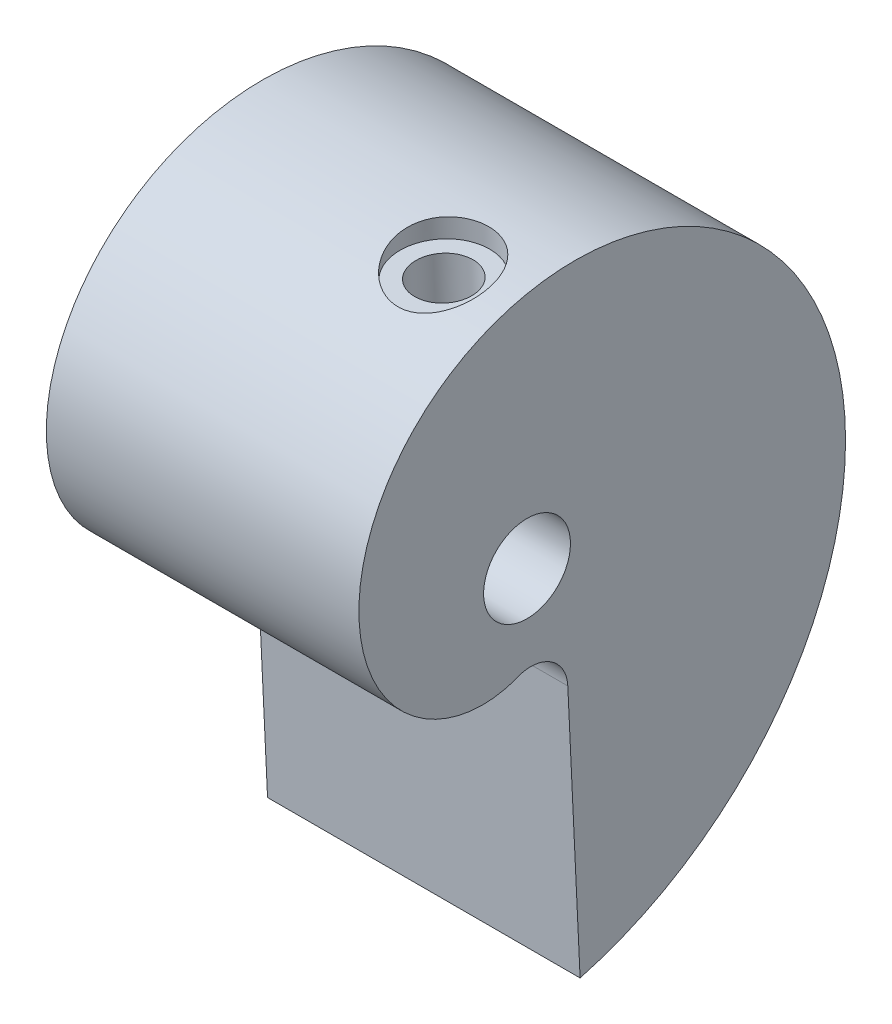
ISO-10303-21;
HEADER;
FILE_DESCRIPTION(('STEP AP214'),'2;1');
FILE_NAME('part.step','',(''),(''),'','','');
FILE_SCHEMA(('AUTOMOTIVE_DESIGN { 1 0 10303 214 1 1 1 1 }'));
ENDSEC;
DATA;
#1=APPLICATION_CONTEXT('core data for automotive mechanical design processes');
#2=APPLICATION_PROTOCOL_DEFINITION('international standard','automotive_design',2000,#1);
#3=PRODUCT_CONTEXT('',#1,'mechanical');
#4=PRODUCT('Part','Part','',(#3));
#5=PRODUCT_RELATED_PRODUCT_CATEGORY('part','',(#4));
#6=PRODUCT_DEFINITION_FORMATION('','',#4);
#7=PRODUCT_DEFINITION_CONTEXT('part definition',#1,'design');
#8=PRODUCT_DEFINITION('design','',#6,#7);
#9=PRODUCT_DEFINITION_SHAPE('','',#8);
#10=(LENGTH_UNIT() NAMED_UNIT(*) SI_UNIT(.MILLI.,.METRE.));
#11=(NAMED_UNIT(*) PLANE_ANGLE_UNIT() SI_UNIT($,.RADIAN.));
#12=(NAMED_UNIT(*) SI_UNIT($,.STERADIAN.) SOLID_ANGLE_UNIT());
#13=UNCERTAINTY_MEASURE_WITH_UNIT(LENGTH_MEASURE(1.E-05),#10,'distance_accuracy_value','');
#14=(GEOMETRIC_REPRESENTATION_CONTEXT(3) GLOBAL_UNCERTAINTY_ASSIGNED_CONTEXT((#13)) GLOBAL_UNIT_ASSIGNED_CONTEXT((#10,
#11,#12)) REPRESENTATION_CONTEXT('',''));
#15=CARTESIAN_POINT('',(0.,0.,0.));
#16=DIRECTION('',(0.,0.,1.));
#17=DIRECTION('',(1.,0.,0.));
#18=AXIS2_PLACEMENT_3D('',#15,#16,#17);
#19=CARTESIAN_POINT('',(21.59,16.3980040897592,0.208936694079272));
#20=DIRECTION('',(1.,0.,0.));
#21=DIRECTION('',(0.,0.,-1.));
#22=AXIS2_PLACEMENT_3D('',#19,#20,#21);
#23=PLANE('',#22);
#24=CARTESIAN_POINT('',(21.59,-26.3254834999287,-3.66701312597946));
#25=CARTESIAN_POINT('',(21.59,-25.8850164099485,-5.29183143138332));
#26=CARTESIAN_POINT('',(21.59,-25.2937709802203,-6.85500985861185));
#27=CARTESIAN_POINT('',(21.59,-23.8451939849136,-9.80629411018198));
#28=CARTESIAN_POINT('',(21.59,-22.987926569709,-11.1943493778112));
#29=CARTESIAN_POINT('',(21.59,-21.0514010056648,-13.7523524342122));
#30=CARTESIAN_POINT('',(21.59,-19.9722145165317,-14.9222640436458));
#31=CARTESIAN_POINT('',(21.59,-17.6424148443339,-17.0111362692066));
#32=CARTESIAN_POINT('',(21.59,-16.3918777440894,-17.9300760548233));
#33=CARTESIAN_POINT('',(21.59,-13.774181132005,-19.4952108297215));
#34=CARTESIAN_POINT('',(21.59,-12.4070989510175,-20.1414006679111));
#35=CARTESIAN_POINT('',(21.59,-9.61304301680638,-21.1506818581234));
#36=CARTESIAN_POINT('',(21.59,-8.18614470800054,-21.5137834309208));
#37=CARTESIAN_POINT('',(21.59,-5.3288100875924,-21.9578966574968));
#38=CARTESIAN_POINT('',(21.59,-3.8984443651538,-22.038932986476));
#39=CARTESIAN_POINT('',(21.59,-1.08794928189315,-21.9307589450492));
#40=CARTESIAN_POINT('',(21.59,0.292117032528461,-21.7415862291151));
#41=CARTESIAN_POINT('',(21.59,2.9528328961559,-21.1147307327981));
#42=CARTESIAN_POINT('',(21.59,4.23342924609723,-20.6770966268395));
#43=CARTESIAN_POINT('',(21.59,6.65237105198453,-19.5836453555955));
#44=CARTESIAN_POINT('',(21.59,7.79067499289227,-18.9278855327688));
#45=CARTESIAN_POINT('',(21.59,9.88997156551444,-17.4355003933537));
#46=CARTESIAN_POINT('',(21.59,10.8509356728284,-16.5989384482919));
#47=CARTESIAN_POINT('',(21.59,12.5693210600784,-14.7874359048066));
#48=CARTESIAN_POINT('',(21.59,13.3267275415238,-13.8125618959728));
#49=CARTESIAN_POINT('',(21.59,14.6212472227952,-11.7701307863269));
#50=CARTESIAN_POINT('',(21.59,15.1583594978757,-10.7026406297588));
#51=CARTESIAN_POINT('',(21.59,16.0052572395325,-8.52186727257846));
#52=CARTESIAN_POINT('',(21.59,16.3150552236038,-7.40864857435838));
#53=CARTESIAN_POINT('',(21.59,16.7098316537026,-5.1825201174866));
#54=CARTESIAN_POINT('',(21.59,16.7948350803545,-4.06966980389497));
#55=CARTESIAN_POINT('',(21.59,16.7515036458065,-1.88772278855217));
#56=CARTESIAN_POINT('',(21.59,16.6232047553048,-0.818678144435623));
#57=CARTESIAN_POINT('',(21.59,16.1728034242135,1.23655153259428));
#58=CARTESIAN_POINT('',(21.59,15.8507460504129,2.22269384951728));
#59=CARTESIAN_POINT('',(21.59,15.0391926205607,4.07878041726697));
#60=CARTESIAN_POINT('',(21.59,14.5497485015278,4.94869279896394));
#61=CARTESIAN_POINT('',(21.59,13.4351525169527,6.5458728071125));
#62=CARTESIAN_POINT('',(21.59,12.8100570020662,7.27312041446994));
#63=CARTESIAN_POINT('',(21.59,11.4596211058448,8.56619770795014));
#64=CARTESIAN_POINT('',(21.59,10.7343389103516,9.13201969506656));
#65=CARTESIAN_POINT('',(21.59,8.46432492032774,10.5713349527582));
#66=CARTESIAN_POINT('',(21.59,6.82631034463374,11.1827796887629));
#67=CARTESIAN_POINT('',(21.59,3.59680348317033,11.7204279571445));
#68=CARTESIAN_POINT('',(21.59,2.00685947245537,11.6474809761802));
#69=CARTESIAN_POINT('',(21.59,-0.874358563474903,10.9424993264994));
#70=CARTESIAN_POINT('',(21.59,-2.16461256267651,10.3118298030999));
#71=CARTESIAN_POINT('',(21.59,-4.28109326467023,8.69840573541426));
#72=CARTESIAN_POINT('',(21.59,-5.10697539238301,7.71726162806799));
#73=CARTESIAN_POINT('',(21.59,-6.23707693613607,5.64499605846387));
#74=CARTESIAN_POINT('',(21.59,-6.54165034000696,4.55542957813348));
#75=CARTESIAN_POINT('',(21.59,-6.67904709626705,2.49487199667445));
#76=CARTESIAN_POINT('',(21.59,-6.51282232630776,1.52510200770758));
#77=CARTESIAN_POINT('',(21.59,-6.17940617515592,0.700777065763977));
#78=B_SPLINE_CURVE_WITH_KNOTS('',3,(#24,#25,#26,#27,#28,#29,#30,#31,#32,#33,#34,#35,#36,#37,#38,
#39,#40,#41,#42,#43,#44,#45,#46,#47,#48,#49,#50,#51,#52,#53,#54,#55,#56,#57,#58,#59,#60,#61,#62,
#63,#64,#65,#66,#67,#68,#69,#70,#71,#72,#73,#74,#75,#76,#77),.UNSPECIFIED.,.F.,.F.,(4,2,2,2,2,2,
2,2,2,2,2,2,2,2,2,2,2,2,2,2,2,2,2,2,2,2,4),(0.,0.03125,0.0625,0.09375,0.125,0.15625,0.1875,
0.21875,0.25,0.28125,0.3125,0.34375,0.375,0.40625,0.4375,0.46875,0.5,0.53125,0.5625,0.59375,
0.625,0.6875,0.75,0.8125,0.875,0.9375,1.),.UNSPECIFIED.);
#79=CARTESIAN_POINT('',(21.59,-26.3254834999287,-3.66701312597946));
#80=VERTEX_POINT('',#79);
#81=CARTESIAN_POINT('',(21.59,-6.17940617515592,0.700777065763977));
#82=VERTEX_POINT('',#81);
#83=EDGE_CURVE('E64',#80,#82,#78,.T.);
#84=ORIENTED_EDGE('',*,*,#83,.T.);
#85=CARTESIAN_POINT('',(21.59,-8.55278837318837,-0.259188983321582));
#86=DIRECTION('',(-1.,0.,0.));
#87=DIRECTION('',(0.,0.,-1.));
#88=AXIS2_PLACEMENT_3D('',#85,#86,#87);
#89=CIRCLE('',#88,2.56017145389412);
#90=CARTESIAN_POINT('',(21.59,-8.4312368938815,-2.81647330682036));
#91=VERTEX_POINT('',#90);
#92=EDGE_CURVE('E60',#82,#91,#89,.T.);
#93=ORIENTED_EDGE('',*,*,#92,.T.);
#94=DIRECTION('',(0.,-0.998872290216758,-0.0474778668131734));
#95=VECTOR('',#94,1.);
#96=CARTESIAN_POINT('',(21.59,-26.3254834999287,-3.66701312597946));
#97=LINE('',#96,#95);
#98=EDGE_CURVE('E40',#91,#80,#97,.T.);
#99=ORIENTED_EDGE('',*,*,#98,.T.);
#100=EDGE_LOOP('',(#84,#93,#99));
#101=FACE_BOUND('',#100,.T.);
#102=CARTESIAN_POINT('',(21.59,0.,0.));
#103=DIRECTION('',(1.,0.,0.));
#104=DIRECTION('',(0.,0.,-1.));
#105=AXIS2_PLACEMENT_3D('',#102,#103,#104);
#106=CIRCLE('',#105,3.);
#107=CARTESIAN_POINT('',(21.59,0.,-3.));
#108=VERTEX_POINT('',#107);
#109=EDGE_CURVE('E73',#108,#108,#106,.T.);
#110=ORIENTED_EDGE('',*,*,#109,.F.);
#111=EDGE_LOOP('',(#110));
#112=FACE_BOUND('',#111,.T.);
#113=ADVANCED_FACE('F15',(#101,#112),#23,.T.);
#114=CARTESIAN_POINT('',(0.,16.3980040897592,0.208936694079272));
#115=DIRECTION('',(1.,0.,0.));
#116=DIRECTION('',(0.,0.,-1.));
#117=AXIS2_PLACEMENT_3D('',#114,#115,#116);
#118=PLANE('',#117);
#119=CARTESIAN_POINT('',(0.,-26.3254834999287,-3.66701312597946));
#120=CARTESIAN_POINT('',(0.,-25.8850164099485,-5.29183143138332));
#121=CARTESIAN_POINT('',(0.,-25.2937709802203,-6.85500985861185));
#122=CARTESIAN_POINT('',(0.,-23.8451939849136,-9.80629411018198));
#123=CARTESIAN_POINT('',(0.,-22.987926569709,-11.1943493778112));
#124=CARTESIAN_POINT('',(0.,-21.0514010056648,-13.7523524342122));
#125=CARTESIAN_POINT('',(0.,-19.9722145165317,-14.9222640436458));
#126=CARTESIAN_POINT('',(0.,-17.6424148443339,-17.0111362692066));
#127=CARTESIAN_POINT('',(0.,-16.3918777440894,-17.9300760548233));
#128=CARTESIAN_POINT('',(0.,-13.774181132005,-19.4952108297215));
#129=CARTESIAN_POINT('',(0.,-12.4070989510175,-20.1414006679111));
#130=CARTESIAN_POINT('',(0.,-9.61304301680638,-21.1506818581234));
#131=CARTESIAN_POINT('',(0.,-8.18614470800054,-21.5137834309208));
#132=CARTESIAN_POINT('',(0.,-5.3288100875924,-21.9578966574968));
#133=CARTESIAN_POINT('',(0.,-3.8984443651538,-22.038932986476));
#134=CARTESIAN_POINT('',(0.,-1.08794928189315,-21.9307589450492));
#135=CARTESIAN_POINT('',(0.,0.292117032528461,-21.7415862291151));
#136=CARTESIAN_POINT('',(0.,2.9528328961559,-21.1147307327981));
#137=CARTESIAN_POINT('',(0.,4.23342924609723,-20.6770966268395));
#138=CARTESIAN_POINT('',(0.,6.65237105198453,-19.5836453555955));
#139=CARTESIAN_POINT('',(0.,7.79067499289227,-18.9278855327688));
#140=CARTESIAN_POINT('',(0.,9.88997156551444,-17.4355003933537));
#141=CARTESIAN_POINT('',(0.,10.8509356728284,-16.5989384482919));
#142=CARTESIAN_POINT('',(0.,12.5693210600784,-14.7874359048066));
#143=CARTESIAN_POINT('',(0.,13.3267275415238,-13.8125618959728));
#144=CARTESIAN_POINT('',(0.,14.6212472227952,-11.7701307863269));
#145=CARTESIAN_POINT('',(0.,15.1583594978757,-10.7026406297588));
#146=CARTESIAN_POINT('',(0.,16.0052572395325,-8.52186727257846));
#147=CARTESIAN_POINT('',(0.,16.3150552236038,-7.40864857435838));
#148=CARTESIAN_POINT('',(0.,16.7098316537026,-5.1825201174866));
#149=CARTESIAN_POINT('',(0.,16.7948350803545,-4.06966980389497));
#150=CARTESIAN_POINT('',(0.,16.7515036458065,-1.88772278855217));
#151=CARTESIAN_POINT('',(0.,16.6232047553048,-0.818678144435623));
#152=CARTESIAN_POINT('',(0.,16.1728034242135,1.23655153259428));
#153=CARTESIAN_POINT('',(0.,15.8507460504129,2.22269384951728));
#154=CARTESIAN_POINT('',(0.,15.0391926205607,4.07878041726697));
#155=CARTESIAN_POINT('',(0.,14.5497485015278,4.94869279896394));
#156=CARTESIAN_POINT('',(0.,13.4351525169527,6.5458728071125));
#157=CARTESIAN_POINT('',(0.,12.8100570020662,7.27312041446994));
#158=CARTESIAN_POINT('',(0.,11.4596211058448,8.56619770795014));
#159=CARTESIAN_POINT('',(0.,10.7343389103516,9.13201969506656));
#160=CARTESIAN_POINT('',(0.,8.46432492032774,10.5713349527582));
#161=CARTESIAN_POINT('',(0.,6.82631034463374,11.1827796887629));
#162=CARTESIAN_POINT('',(0.,3.59680348317033,11.7204279571445));
#163=CARTESIAN_POINT('',(0.,2.00685947245537,11.6474809761802));
#164=CARTESIAN_POINT('',(0.,-0.874358563474903,10.9424993264994));
#165=CARTESIAN_POINT('',(0.,-2.16461256267651,10.3118298030999));
#166=CARTESIAN_POINT('',(0.,-4.28109326467023,8.69840573541426));
#167=CARTESIAN_POINT('',(0.,-5.10697539238301,7.71726162806799));
#168=CARTESIAN_POINT('',(0.,-6.23707693613607,5.64499605846387));
#169=CARTESIAN_POINT('',(0.,-6.54165034000696,4.55542957813348));
#170=CARTESIAN_POINT('',(0.,-6.67904709626705,2.49487199667445));
#171=CARTESIAN_POINT('',(0.,-6.51282232630776,1.52510200770758));
#172=CARTESIAN_POINT('',(0.,-6.17940617515592,0.700777065763977));
#173=B_SPLINE_CURVE_WITH_KNOTS('',3,(#119,#120,#121,#122,#123,#124,#125,#126,#127,#128,#129,
#130,#131,#132,#133,#134,#135,#136,#137,#138,#139,#140,#141,#142,#143,#144,#145,#146,#147,#148,
#149,#150,#151,#152,#153,#154,#155,#156,#157,#158,#159,#160,#161,#162,#163,#164,#165,#166,#167,
#168,#169,#170,#171,#172),.UNSPECIFIED.,.F.,.F.,(4,2,2,2,2,2,2,2,2,2,2,2,2,2,2,2,2,2,2,2,2,2,2,
2,2,2,4),(0.,0.03125,0.0625,0.09375,0.125,0.15625,0.1875,0.21875,0.25,0.28125,0.3125,0.34375,
0.375,0.40625,0.4375,0.46875,0.5,0.53125,0.5625,0.59375,0.625,0.6875,0.75,0.8125,0.875,0.9375,
1.),.UNSPECIFIED.);
#174=CARTESIAN_POINT('',(0.,-26.3254834999287,-3.66701312597946));
#175=VERTEX_POINT('',#174);
#176=CARTESIAN_POINT('',(0.,-6.17940617515592,0.700777065763977));
#177=VERTEX_POINT('',#176);
#178=EDGE_CURVE('E70',#175,#177,#173,.T.);
#179=ORIENTED_EDGE('',*,*,#178,.F.);
#180=DIRECTION('',(0.,-0.998872290216758,-0.0474778668131734));
#181=VECTOR('',#180,1.);
#182=CARTESIAN_POINT('',(0.,-26.3254834999287,-3.66701312597946));
#183=LINE('',#182,#181);
#184=CARTESIAN_POINT('',(0.,-8.4312368938815,-2.81647330682036));
#185=VERTEX_POINT('',#184);
#186=EDGE_CURVE('E57',#185,#175,#183,.T.);
#187=ORIENTED_EDGE('',*,*,#186,.F.);
#188=CARTESIAN_POINT('',(0.,-8.55278837318837,-0.259188983321582));
#189=DIRECTION('',(-1.,0.,0.));
#190=DIRECTION('',(0.,0.,-1.));
#191=AXIS2_PLACEMENT_3D('',#188,#189,#190);
#192=CIRCLE('',#191,2.56017145389412);
#193=EDGE_CURVE('E52',#177,#185,#192,.T.);
#194=ORIENTED_EDGE('',*,*,#193,.F.);
#195=EDGE_LOOP('',(#179,#187,#194));
#196=FACE_BOUND('',#195,.T.);
#197=CARTESIAN_POINT('',(0.,0.,0.));
#198=DIRECTION('',(1.,0.,0.));
#199=DIRECTION('',(0.,0.,-1.));
#200=AXIS2_PLACEMENT_3D('',#197,#198,#199);
#201=CIRCLE('',#200,3.);
#202=CARTESIAN_POINT('',(0.,0.,-3.));
#203=VERTEX_POINT('',#202);
#204=EDGE_CURVE('E77',#203,#203,#201,.T.);
#205=ORIENTED_EDGE('',*,*,#204,.T.);
#206=EDGE_LOOP('',(#205));
#207=FACE_BOUND('',#206,.T.);
#208=ADVANCED_FACE('F108',(#196,#207),#118,.F.);
#209=DIRECTION('',(-1.,0.,0.));
#210=VECTOR('',#209,1.);
#211=SURFACE_OF_LINEAR_EXTRUSION('',#78,#210);
#212=CARTESIAN_POINT('',(16.565,16.7506396740937,-2.3824020185819));
#213=CARTESIAN_POINT('',(16.7433125657749,16.7506413895993,-2.38239572343409));
#214=CARTESIAN_POINT('',(16.9217084574211,16.749821870359,-2.36735698221768));
#215=CARTESIAN_POINT('',(17.2735404531971,16.7463257784659,-2.30760094349494));
#216=CARTESIAN_POINT('',(17.4469725353157,16.7436477419284,-2.26286025207603));
#217=CARTESIAN_POINT('',(17.7838175619757,16.7358008377302,-2.14500470832748));
#218=CARTESIAN_POINT('',(17.9472329710051,16.7306325855541,-2.07189686812296));
#219=CARTESIAN_POINT('',(18.2593967109722,16.7168613322798,-1.89946022909937));
#220=CARTESIAN_POINT('',(18.4081474456539,16.7082588952633,-1.80013573740177));
#221=CARTESIAN_POINT('',(18.6865194273289,16.6865245866847,-1.57839471352308));
#222=CARTESIAN_POINT('',(18.816172777858,16.6734004432769,-1.45601774158622));
#223=CARTESIAN_POINT('',(19.0529395131531,16.6415294219983,-1.19174783860988));
#224=CARTESIAN_POINT('',(19.1600538561791,16.6227827832536,-1.04985573769259));
#225=CARTESIAN_POINT('',(19.348142330831,16.5789328491663,-0.751848833363513));
#226=CARTESIAN_POINT('',(19.4292768024721,16.553870320362,-0.595829205294697));
#227=CARTESIAN_POINT('',(19.5642185684297,16.4968714939526,-0.273578315973268));
#228=CARTESIAN_POINT('',(19.6180270069779,16.4649354842427,-0.10734748262456));
#229=CARTESIAN_POINT('',(19.6971716405541,16.394258927079,0.230275295922528));
#230=CARTESIAN_POINT('',(19.722518372012,16.3555209038535,0.40166530706758));
#231=CARTESIAN_POINT('',(19.744621054064,16.2718922700363,0.744772007699112));
#232=CARTESIAN_POINT('',(19.7413740122333,16.2270010159743,0.916488729496721));
#233=CARTESIAN_POINT('',(19.7065779354297,16.131231758128,1.25944455369325));
#234=CARTESIAN_POINT('',(19.6744043268891,16.0802432751121,1.43058903606567));
#235=CARTESIAN_POINT('',(19.5822767862168,15.9748963486612,1.76413828861455));
#236=CARTESIAN_POINT('',(19.5223164634281,15.9205371324849,1.92654103868751));
#237=CARTESIAN_POINT('',(19.37349122948,15.8084495214842,2.24504073687003));
#238=CARTESIAN_POINT('',(19.2835681169074,15.7506732515505,2.40062724447312));
#239=CARTESIAN_POINT('',(19.0779746661179,15.6367051121502,2.69441582491913));
#240=CARTESIAN_POINT('',(18.9622977115637,15.5805136540196,2.83261341612552));
#241=CARTESIAN_POINT('',(18.7052597507175,15.4718331439367,3.09055875271198));
#242=CARTESIAN_POINT('',(18.563448220764,15.4194359017119,3.20990127896188));
#243=CARTESIAN_POINT('',(18.3354405886196,15.3473231379403,3.36967949623941));
#244=CARTESIAN_POINT('',(18.2568465828785,15.324356219765,3.41975316580401));
#245=CARTESIAN_POINT('',(18.0950375543645,15.2810258558235,3.51306824531798));
#246=CARTESIAN_POINT('',(18.0118248362869,15.2606611280455,3.55631302212939));
#247=CARTESIAN_POINT('',(17.8449506674736,15.2237661173167,3.63386819559383));
#248=CARTESIAN_POINT('',(17.7614559986682,15.2071103843645,3.66847836816939));
#249=CARTESIAN_POINT('',(17.5913768396874,15.1769484403086,3.73067224852884));
#250=CARTESIAN_POINT('',(17.5047938330402,15.1634407398821,3.75825927950836));
#251=CARTESIAN_POINT('',(17.3291969657524,15.1398794833412,3.80610837444833));
#252=CARTESIAN_POINT('',(17.2401839282175,15.1298247729152,3.82637288639647));
#253=CARTESIAN_POINT('',(17.0604349726318,15.113407621694,3.85934439959767));
#254=CARTESIAN_POINT('',(16.9696991833952,15.1070449059538,3.87205196362262));
#255=CARTESIAN_POINT('',(16.7945533182601,15.0985240892335,3.88904578045354));
#256=CARTESIAN_POINT('',(16.7102142050666,15.0960717840662,3.89392151576271));
#257=CARTESIAN_POINT('',(16.5413523279664,15.0944819837441,3.89708380613252));
#258=CARTESIAN_POINT('',(16.4568295124437,15.0953455878203,3.89536817614142));
#259=CARTESIAN_POINT('',(16.2883132554156,15.1003719089667,3.88536114739973));
#260=CARTESIAN_POINT('',(16.2043195602009,15.1045329006177,3.87707318774104));
#261=CARTESIAN_POINT('',(16.0374380848698,15.1160570440926,3.85402351718646));
#262=CARTESIAN_POINT('',(15.9545507303056,15.1234213934654,3.83925938520938));
#263=CARTESIAN_POINT('',(15.7135282259701,15.1495616401688,3.78655914799319));
#264=CARTESIAN_POINT('',(15.5576580863421,15.1725644974324,3.73987333526957));
#265=CARTESIAN_POINT('',(15.2563374938122,15.2283883617697,3.6243856032296));
#266=CARTESIAN_POINT('',(15.1108890695337,15.2612112739512,3.55557939232459));
#267=CARTESIAN_POINT('',(14.8265360489511,15.3363613688962,3.39404776600376));
#268=CARTESIAN_POINT('',(14.6883111815686,15.3790784167601,3.30030741267247));
#269=CARTESIAN_POINT('',(14.4294546693891,15.4703504029779,3.09340467821783));
#270=CARTESIAN_POINT('',(14.3088294301683,15.5189074551929,2.98023525813181));
#271=CARTESIAN_POINT('',(14.0789724060991,15.6231462990423,2.72781772189997));
#272=CARTESIAN_POINT('',(13.9713199073631,15.6790889471381,2.58723636566584));
#273=CARTESIAN_POINT('',(13.7815053033552,15.7918180971415,2.29008118723744));
#274=CARTESIAN_POINT('',(13.6993495787082,15.8486048065575,2.13350337490384));
#275=CARTESIAN_POINT('',(13.5602533042469,15.9623970325448,1.80219910865937));
#276=CARTESIAN_POINT('',(13.504326409703,16.0193369007987,1.62702235329759));
#277=CARTESIAN_POINT('',(13.4242595372715,16.1287696936005,1.26820289867208));
#278=CARTESIAN_POINT('',(13.4001155032531,16.1812631847952,1.0845612827911));
#279=CARTESIAN_POINT('',(13.385193870193,16.2787719932153,0.718254653214319));
#280=CARTESIAN_POINT('',(13.3936966228172,16.3239259866846,0.535656438380682));
#281=CARTESIAN_POINT('',(13.4429083099938,16.4069046087537,0.173155051099132));
#282=CARTESIAN_POINT('',(13.4836093005975,16.4447310423436,-0.00674877495435066));
#283=CARTESIAN_POINT('',(13.5942352875637,16.5112585207308,-0.350944470852361));
#284=CARTESIAN_POINT('',(13.662934134937,16.5402625664061,-0.515572664111006));
#285=CARTESIAN_POINT('',(13.8276352586509,16.5913323509495,-0.831717074035158));
#286=CARTESIAN_POINT('',(13.9236341626166,16.6133989460922,-0.983234907209561));
#287=CARTESIAN_POINT('',(14.1382408076017,16.6509650936835,-1.26576374035269));
#288=CARTESIAN_POINT('',(14.2564004615726,16.6665779170517,-1.39710052998255));
#289=CARTESIAN_POINT('',(14.5131439312932,16.692803887894,-1.63864995249749));
#290=CARTESIAN_POINT('',(14.6517311068004,16.7034162117183,-1.74885910360259));
#291=CARTESIAN_POINT('',(14.9458446839421,16.7207600224453,-1.9451849781874));
#292=CARTESIAN_POINT('',(15.1014212227303,16.7274796324812,-2.03122756112737));
#293=CARTESIAN_POINT('',(15.4247138575761,16.7380174528368,-2.17622583051713));
#294=CARTESIAN_POINT('',(15.592420784005,16.7418378301567,-2.23520173460522));
#295=CARTESIAN_POINT('',(15.8944508944589,16.7467084225448,-2.31383530128008));
#296=CARTESIAN_POINT('',(16.0272363012908,16.7482011961144,-2.33950607055206));
#297=CARTESIAN_POINT('',(16.2949985372011,16.7501661752923,-2.37379186153075));
#298=CARTESIAN_POINT('',(16.429975378834,16.7506383750518,-2.38240678549187));
#299=CARTESIAN_POINT('',(16.565,16.7506396740937,-2.3824020185819));
#300=B_SPLINE_CURVE_WITH_KNOTS('',3,(#212,#213,#214,#215,#216,#217,#218,#219,#220,#221,#222,
#223,#224,#225,#226,#227,#228,#229,#230,#231,#232,#233,#234,#235,#236,#237,#238,#239,#240,#241,
#242,#243,#244,#245,#246,#247,#248,#249,#250,#251,#252,#253,#254,#255,#256,#257,#258,#259,#260,
#261,#262,#263,#264,#265,#266,#267,#268,#269,#270,#271,#272,#273,#274,#275,#276,#277,#278,#279,
#280,#281,#282,#283,#284,#285,#286,#287,#288,#289,#290,#291,#292,#293,#294,#295,#296,#297,#298,
#299),.UNSPECIFIED.,.T.,.F.,(4,2,2,2,2,2,2,2,2,2,2,2,2,2,2,2,2,2,2,2,2,2,2,2,2,2,2,2,2,2,2,2,2,
2,2,2,2,2,2,2,2,2,2,4),(0.,0.53445164589435,1.06932473792819,1.60406569789055,2.13871886013214,
2.67246273028415,3.2061839033957,3.73654461265796,4.26688311212228,4.79702521723492,
5.32722280398092,5.86915066299671,6.41120322172102,6.97489189795413,7.53872555709591,
8.1133856989789,8.40100316382574,8.6884783783365,8.96383534701767,9.23906177966749,
9.51419611619281,9.7893099606797,10.042539219592,10.295852431789,10.5490331806023,
10.8023086604135,11.2929022099079,11.7835909971805,12.2985553916675,12.8137067479945,
13.3682975128205,13.9230269535227,14.4977165883669,15.0723328741687,15.6343561150362,
16.1962407367653,16.7357872484509,17.2752671389078,17.8048292042514,18.3344784651681,
18.8657353155608,19.3965946916137,19.8012981803549,20.2060039884107),.UNSPECIFIED.);
#301=CARTESIAN_POINT('',(16.565,16.7506396740937,-2.3824020185819));
#302=VERTEX_POINT('',#301);
#303=EDGE_CURVE('E88',#302,#302,#300,.T.);
#304=ORIENTED_EDGE('',*,*,#303,.T.);
#305=EDGE_LOOP('',(#304));
#306=FACE_BOUND('',#305,.T.);
#307=ORIENTED_EDGE('',*,*,#178,.T.);
#308=DIRECTION('',(-1.,0.,0.));
#309=VECTOR('',#308,1.);
#310=CARTESIAN_POINT('',(21.59,-6.17940617515592,0.700777065763977));
#311=LINE('',#310,#309);
#312=EDGE_CURVE('E9',#82,#177,#311,.T.);
#313=ORIENTED_EDGE('',*,*,#312,.F.);
#314=ORIENTED_EDGE('',*,*,#83,.F.);
#315=DIRECTION('',(-1.,0.,0.));
#316=VECTOR('',#315,1.);
#317=CARTESIAN_POINT('',(21.59,-26.3254834999287,-3.66701312597946));
#318=LINE('',#317,#316);
#319=EDGE_CURVE('E71',#80,#175,#318,.T.);
#320=ORIENTED_EDGE('',*,*,#319,.T.);
#321=EDGE_LOOP('',(#307,#313,#314,#320));
#322=FACE_BOUND('',#321,.T.);
#323=ADVANCED_FACE('F17',(#306,#322),#211,.F.);
#324=CARTESIAN_POINT('',(21.59,-8.55278837318837,-0.259188983321582));
#325=DIRECTION('',(-1.,0.,0.));
#326=DIRECTION('',(0.,0.,1.));
#327=AXIS2_PLACEMENT_3D('',#324,#325,#326);
#328=CYLINDRICAL_SURFACE('',#327,2.56017145389412);
#329=ORIENTED_EDGE('',*,*,#193,.T.);
#330=DIRECTION('',(-1.,0.,0.));
#331=VECTOR('',#330,1.);
#332=CARTESIAN_POINT('',(21.59,-8.4312368938815,-2.81647330682036));
#333=LINE('',#332,#331);
#334=EDGE_CURVE('E31',#91,#185,#333,.T.);
#335=ORIENTED_EDGE('',*,*,#334,.F.);
#336=ORIENTED_EDGE('',*,*,#92,.F.);
#337=ORIENTED_EDGE('',*,*,#312,.T.);
#338=EDGE_LOOP('',(#329,#335,#336,#337));
#339=FACE_BOUND('',#338,.T.);
#340=ADVANCED_FACE('F61',(#339),#328,.F.);
#341=CARTESIAN_POINT('',(21.59,-26.3254834999287,-3.66701312597946));
#342=DIRECTION('',(0.,0.0474778668131734,-0.998872290216758));
#343=DIRECTION('',(0.,0.998872290216758,0.0474778668131734));
#344=AXIS2_PLACEMENT_3D('',#341,#342,#343);
#345=PLANE('',#344);
#346=ORIENTED_EDGE('',*,*,#186,.T.);
#347=ORIENTED_EDGE('',*,*,#319,.F.);
#348=ORIENTED_EDGE('',*,*,#98,.F.);
#349=ORIENTED_EDGE('',*,*,#334,.T.);
#350=EDGE_LOOP('',(#346,#347,#348,#349));
#351=FACE_BOUND('',#350,.T.);
#352=ADVANCED_FACE('F104',(#351),#345,.F.);
#353=CARTESIAN_POINT('',(21.59,0.,0.));
#354=DIRECTION('',(-1.,0.,0.));
#355=DIRECTION('',(0.,0.,1.));
#356=AXIS2_PLACEMENT_3D('',#353,#354,#355);
#357=CYLINDRICAL_SURFACE('',#356,3.);
#358=CARTESIAN_POINT('',(16.565,2.12028038204539,2.12235979549027));
#359=CARTESIAN_POINT('',(16.4667328598408,2.12028848918387,2.12235574640076));
#360=CARTESIAN_POINT('',(16.3684396592825,2.12726700712759,2.11544854411303));
#361=CARTESIAN_POINT('',(16.1753956042412,2.15382911691391,2.08838492945828));
#362=CARTESIAN_POINT('',(16.0806515368345,2.17343567338186,2.06820437751953));
#363=CARTESIAN_POINT('',(15.898115540295,2.22182310173142,2.01611940184166));
#364=CARTESIAN_POINT('',(15.8102646347584,2.25051228608713,1.98433167860403));
#365=CARTESIAN_POINT('',(15.6415179949459,2.31379446378662,1.91016493745002));
#366=CARTESIAN_POINT('',(15.5606235348317,2.34838853523675,1.86778398477872));
#367=CARTESIAN_POINT('',(15.3939764145017,2.42634419581015,1.76567376420377));
#368=CARTESIAN_POINT('',(15.3095005764119,2.47022479874888,1.70425677328391));
#369=CARTESIAN_POINT('',(15.1512681262757,2.55831415648357,1.56893677481745));
#370=CARTESIAN_POINT('',(15.0775234546585,2.60252322014981,1.49502005366527));
#371=CARTESIAN_POINT('',(14.9319381685596,2.69434111659312,1.32338517364023));
#372=CARTESIAN_POINT('',(14.8620133455485,2.74147712399974,1.22376200962437));
#373=CARTESIAN_POINT('',(14.74092456293,2.82705144975862,1.01040221396568));
#374=CARTESIAN_POINT('',(14.6897263388148,2.86550560364039,0.896691873719949));
#375=CARTESIAN_POINT('',(14.6194406320562,2.92138993541408,0.688486460837518));
#376=CARTESIAN_POINT('',(14.5955107790667,2.94167661806749,0.596380838870981));
#377=CARTESIAN_POINT('',(14.5610706488714,2.97361755963886,0.408255826934814));
#378=CARTESIAN_POINT('',(14.550550190733,2.98527836483119,0.31223946338016));
#379=CARTESIAN_POINT('',(14.5435070950218,2.99921453700448,0.118857670982177));
#380=CARTESIAN_POINT('',(14.5470072123757,3.00147463482578,0.0214903048783783));
#381=CARTESIAN_POINT('',(14.5678489053777,2.99664936371328,-0.171518644435029));
#382=CARTESIAN_POINT('',(14.5851945804805,2.98956122650674,-0.267159707935346));
#383=CARTESIAN_POINT('',(14.6323848829118,2.96712722760513,-0.452468583282781));
#384=CARTESIAN_POINT('',(14.6620100738361,2.95192505613619,-0.542210701604351));
#385=CARTESIAN_POINT('',(14.7324642390206,2.91474396742281,-0.715642458399995));
#386=CARTESIAN_POINT('',(14.7732953323774,2.89276376831946,-0.799330948314167));
#387=CARTESIAN_POINT('',(14.8700346253892,2.8409088137854,-0.968460757395493));
#388=CARTESIAN_POINT('',(14.9271235396893,2.81042345250388,-1.05303628307403));
#389=CARTESIAN_POINT('',(15.052107400767,2.74554521098296,-1.21218164141392));
#390=CARTESIAN_POINT('',(15.1200150156509,2.71114776358467,-1.28673955296213));
#391=CARTESIAN_POINT('',(15.2776434629101,2.63524990882614,-1.43652944196564));
#392=CARTESIAN_POINT('',(15.3691138068383,2.59351953387313,-1.50981173568687));
#393=CARTESIAN_POINT('',(15.5641707375766,2.51308481925863,-1.64020286542295));
#394=CARTESIAN_POINT('',(15.6677497479923,2.47437861240433,-1.69732173916104));
#395=CARTESIAN_POINT('',(15.8599239808636,2.41399774725226,-1.78175338308866));
#396=CARTESIAN_POINT('',(15.9462288128377,2.39046162805908,-1.81292374997661));
#397=CARTESIAN_POINT('',(16.1239987409443,2.35152611340619,-1.8631546249348));
#398=CARTESIAN_POINT('',(16.2154541774374,2.33611201342263,-1.88223703043339));
#399=CARTESIAN_POINT('',(16.4021128112496,2.31584458356227,-1.90712969037208));
#400=CARTESIAN_POINT('',(16.4973395024567,2.31107375592378,-1.91283627813399));
#401=CARTESIAN_POINT('',(16.6874607323001,2.31329557478278,-1.91014793487933));
#402=CARTESIAN_POINT('',(16.7823552399239,2.32028929172951,-1.90175172065692));
#403=CARTESIAN_POINT('',(16.9586160296345,2.34336147118843,-1.87321469247652));
#404=CARTESIAN_POINT('',(17.0403497189188,2.35839780834754,-1.8544138638391));
#405=CARTESIAN_POINT('',(17.19949554989,2.39480473578162,-1.80715213868883));
#406=CARTESIAN_POINT('',(17.2769037521532,2.41618099187566,-1.77868259818631));
#407=CARTESIAN_POINT('',(17.4600051025368,2.4736189419872,-1.69840930630491));
#408=CARTESIAN_POINT('',(17.5629020560131,2.51197680379099,-1.64186223169713));
#409=CARTESIAN_POINT('',(17.7568810771684,2.59177214646469,-1.51277668605855));
#410=CARTESIAN_POINT('',(17.8479411400979,2.63321514396262,-1.4402090897587));
#411=CARTESIAN_POINT('',(18.0181794819501,2.71500637650003,-1.2794467788588));
#412=CARTESIAN_POINT('',(18.0971907161838,2.75533380270866,-1.19106388925131));
#413=CARTESIAN_POINT('',(18.2400039987763,2.83003944321896,-1.00064909496543));
#414=CARTESIAN_POINT('',(18.3038304372845,2.86442717330891,-0.898639495086295));
#415=CARTESIAN_POINT('',(18.4039161810089,2.91809353527471,-0.70225199222536));
#416=CARTESIAN_POINT('',(18.4430670671926,2.93897614094036,-0.609789632069127));
#417=CARTESIAN_POINT('',(18.5078362764038,2.97220570414022,-0.418767233075199));
#418=CARTESIAN_POINT('',(18.5334633325463,2.9845581716697,-0.320211175344466));
#419=CARTESIAN_POINT('',(18.5698973317487,2.99933307232094,-0.119158499306342));
#420=CARTESIAN_POINT('',(18.5806363557601,3.0017100967523,-0.016646000502358));
#421=CARTESIAN_POINT('',(18.5863803799619,2.99582780040363,0.188515646070647));
#422=CARTESIAN_POINT('',(18.5813879793598,2.98757023684507,0.291164768464987));
#423=CARTESIAN_POINT('',(18.5569878371614,2.96196684512782,0.485408367359835));
#424=CARTESIAN_POINT('',(18.5387107864744,2.94536370839101,0.577248193336323));
#425=CARTESIAN_POINT('',(18.4899650043451,2.90466382257783,0.755860162803808));
#426=CARTESIAN_POINT('',(18.4594943206659,2.88056587369737,0.842631492262874));
#427=CARTESIAN_POINT('',(18.3856377944098,2.82493697968474,1.01404855691688));
#428=CARTESIAN_POINT('',(18.3416360099734,2.79307122568373,1.09831760125453));
#429=CARTESIAN_POINT('',(18.2429253261677,2.72476102863076,1.25827469012518));
#430=CARTESIAN_POINT('',(18.1882103677206,2.68831399873056,1.33395784027541));
#431=CARTESIAN_POINT('',(18.0598992821813,2.60701572773753,1.48732606234674));
#432=CARTESIAN_POINT('',(17.9846856967384,2.56174675585185,1.56343617799663));
#433=CARTESIAN_POINT('',(17.8228381890139,2.47141451097108,1.7026452151688));
#434=CARTESIAN_POINT('',(17.736195042731,2.42635143485822,1.76573352109393));
#435=CARTESIAN_POINT('',(17.5581723264889,2.34321746911373,1.87449071596821));
#436=CARTESIAN_POINT('',(17.4674353636179,2.30488489975618,1.92100682772764));
#437=CARTESIAN_POINT('',(17.2775170660789,2.23609615976014,2.00066258472565));
#438=CARTESIAN_POINT('',(17.1783512964321,2.20562587302337,2.03382626405166));
#439=CARTESIAN_POINT('',(16.9937200304283,2.16196405390712,2.08007731395642));
#440=CARTESIAN_POINT('',(16.9094667801936,2.14653840678831,2.09584962228186));
#441=CARTESIAN_POINT('',(16.7384806064526,2.12569838741478,2.11698704174864));
#442=CARTESIAN_POINT('',(16.651750458181,2.12027322504481,2.12236337003583));
#443=CARTESIAN_POINT('',(16.565,2.12028038204539,2.12235979549027));
#444=B_SPLINE_CURVE_WITH_KNOTS('',3,(#358,#359,#360,#361,#362,#363,#364,#365,#366,#367,#368,
#369,#370,#371,#372,#373,#374,#375,#376,#377,#378,#379,#380,#381,#382,#383,#384,#385,#386,#387,
#388,#389,#390,#391,#392,#393,#394,#395,#396,#397,#398,#399,#400,#401,#402,#403,#404,#405,#406,
#407,#408,#409,#410,#411,#412,#413,#414,#415,#416,#417,#418,#419,#420,#421,#422,#423,#424,#425,
#426,#427,#428,#429,#430,#431,#432,#433,#434,#435,#436,#437,#438,#439,#440,#441,#442,#443),
.UNSPECIFIED.,.T.,.F.,(4,2,2,2,2,2,2,2,2,2,2,2,2,2,2,2,2,2,2,2,2,2,2,2,2,2,2,2,2,2,2,2,2,2,2,2,
2,2,2,2,2,2,4),(0.,0.294403536380054,0.589343975595909,0.881397200780238,1.17350380579791,
1.51211387476108,1.85109787614565,2.24051778682946,2.62922155934117,2.91986353918584,
3.21028472066952,3.5011774368684,3.79215631384676,4.07814540042061,4.36418860638471,
4.682475326583,5.00113752008125,5.3727909960692,5.7442131606791,6.02735164683166,
6.3099757476852,6.59478313131646,6.87961643081161,7.13424228210731,7.38909637504133,
7.7577000588713,8.12697946404347,8.50098664778867,8.87438897473935,9.18078287749257,
9.48697868121596,9.79456680098566,10.1021041025096,10.3861411287429,10.6702236483578,
10.9698648671405,11.2696760468771,11.6168834583152,11.9643728107566,12.2899631035632,
12.6149646923713,12.8751457033016,13.1350458248448),.UNSPECIFIED.);
#445=CARTESIAN_POINT('',(16.565,2.12028038204539,2.12235979549027));
#446=VERTEX_POINT('',#445);
#447=EDGE_CURVE('E21',#446,#446,#444,.T.);
#448=ORIENTED_EDGE('',*,*,#447,.F.);
#449=EDGE_LOOP('',(#448));
#450=FACE_BOUND('',#449,.T.);
#451=ORIENTED_EDGE('',*,*,#109,.T.);
#452=EDGE_LOOP('',(#451));
#453=FACE_BOUND('',#452,.T.);
#454=ORIENTED_EDGE('',*,*,#204,.F.);
#455=EDGE_LOOP('',(#454));
#456=FACE_BOUND('',#455,.T.);
#457=ADVANCED_FACE('F99',(#450,#453,#456),#357,.F.);
#458=CARTESIAN_POINT('',(16.565,20.2970849372045,0.964750253643683));
#459=DIRECTION('',(0.,-0.998872290216758,-0.0474778668131734));
#460=DIRECTION('',(0.,0.0474778668131734,-0.998872290216758));
#461=AXIS2_PLACEMENT_3D('',#458,#459,#460);
#462=CYLINDRICAL_SURFACE('',#461,3.175);
#463=CARTESIAN_POINT('',(16.565,15.2228137029034,0.723562690232762));
#464=DIRECTION('',(0.,-0.998872290216758,-0.0474778668131734));
#465=DIRECTION('',(0.,0.0474778668131734,-0.998872290216758));
#466=AXIS2_PLACEMENT_3D('',#463,#464,#465);
#467=CIRCLE('',#466,3.175);
#468=CARTESIAN_POINT('',(16.565,15.3735559300352,-2.44785683120544));
#469=VERTEX_POINT('',#468);
#470=EDGE_CURVE('E93',#469,#469,#467,.T.);
#471=ORIENTED_EDGE('',*,*,#470,.T.);
#472=EDGE_LOOP('',(#471));
#473=FACE_BOUND('',#472,.T.);
#474=ORIENTED_EDGE('',*,*,#303,.F.);
#475=EDGE_LOOP('',(#474));
#476=FACE_BOUND('',#475,.T.);
#477=ADVANCED_FACE('F94',(#473,#476),#462,.F.);
#478=CARTESIAN_POINT('',(16.565,15.2228137029034,0.723562690232762));
#479=DIRECTION('',(0.,-0.998872290216758,-0.0474778668131734));
#480=DIRECTION('',(0.,0.0474778668131734,-0.998872290216758));
#481=AXIS2_PLACEMENT_3D('',#478,#479,#480);
#482=PLANE('',#481);
#483=CARTESIAN_POINT('',(16.565,15.2228137029034,0.723562690232762));
#484=DIRECTION('',(0.,0.998872290216758,0.0474778668131734));
#485=DIRECTION('',(0.,-0.0474778668131734,0.998872290216758));
#486=AXIS2_PLACEMENT_3D('',#483,#484,#485);
#487=CIRCLE('',#486,2.0193);
#488=CARTESIAN_POINT('',(16.565,15.1269416464476,2.74058550586746));
#489=VERTEX_POINT('',#488);
#490=EDGE_CURVE('E181',#489,#489,#487,.T.);
#491=ORIENTED_EDGE('',*,*,#490,.F.);
#492=EDGE_LOOP('',(#491));
#493=FACE_BOUND('',#492,.T.);
#494=ORIENTED_EDGE('',*,*,#470,.F.);
#495=EDGE_LOOP('',(#494));
#496=FACE_BOUND('',#495,.T.);
#497=ADVANCED_FACE('F98',(#493,#496),#482,.F.);
#498=CARTESIAN_POINT('',(16.565,15.2228137029034,0.723562690232762));
#499=DIRECTION('',(0.,0.998872290216758,0.0474778668131734));
#500=DIRECTION('',(0.,-0.0474778668131734,0.998872290216758));
#501=AXIS2_PLACEMENT_3D('',#498,#499,#500);
#502=CYLINDRICAL_SURFACE('',#501,2.0193);
#503=ORIENTED_EDGE('',*,*,#447,.T.);
#504=EDGE_LOOP('',(#503));
#505=FACE_BOUND('',#504,.T.);
#506=ORIENTED_EDGE('',*,*,#490,.T.);
#507=EDGE_LOOP('',(#506));
#508=FACE_BOUND('',#507,.T.);
#509=ADVANCED_FACE('F163',(#505,#508),#502,.F.);
#510=CLOSED_SHELL('',(#113,#208,#323,#340,#352,#457,#477,#497,#509));
#511=MANIFOLD_SOLID_BREP('B1',#510);
#512=ADVANCED_BREP_SHAPE_REPRESENTATION('',(#18,#511),#14);
#513=SHAPE_DEFINITION_REPRESENTATION(#9,#512);
ENDSEC;
END-ISO-10303-21;
